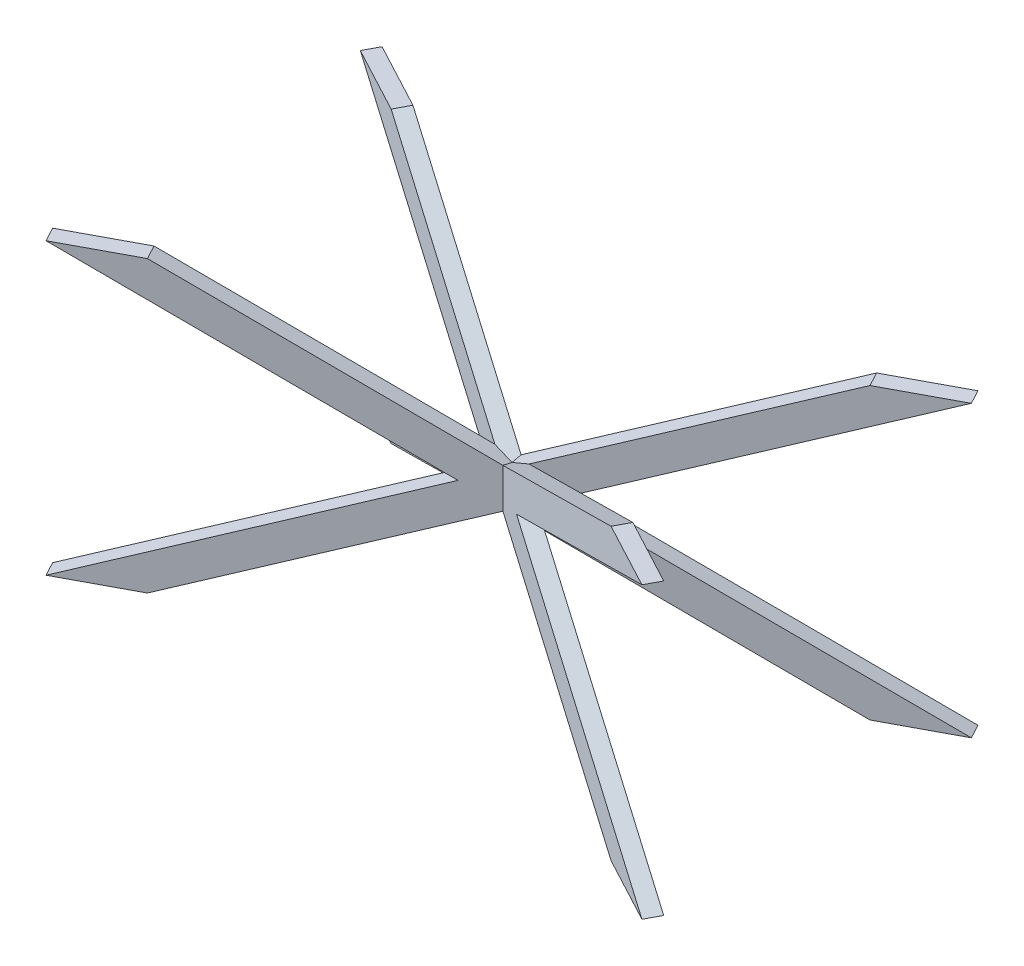
ISO-10303-21;
HEADER;
FILE_DESCRIPTION(('STEP AP214'),'2;1');
FILE_NAME('part.step','',(''),(''),'','','');
FILE_SCHEMA(('AUTOMOTIVE_DESIGN { 1 0 10303 214 1 1 1 1 }'));
ENDSEC;
DATA;
#1=APPLICATION_CONTEXT('core data for automotive mechanical design processes');
#2=APPLICATION_PROTOCOL_DEFINITION('international standard','automotive_design',2000,#1);
#3=PRODUCT_CONTEXT('',#1,'mechanical');
#4=PRODUCT('Part','Part','',(#3));
#5=PRODUCT_RELATED_PRODUCT_CATEGORY('part','',(#4));
#6=PRODUCT_DEFINITION_FORMATION('','',#4);
#7=PRODUCT_DEFINITION_CONTEXT('part definition',#1,'design');
#8=PRODUCT_DEFINITION('design','',#6,#7);
#9=PRODUCT_DEFINITION_SHAPE('','',#8);
#10=(LENGTH_UNIT() NAMED_UNIT(*) SI_UNIT(.MILLI.,.METRE.));
#11=(NAMED_UNIT(*) PLANE_ANGLE_UNIT() SI_UNIT($,.RADIAN.));
#12=(NAMED_UNIT(*) SI_UNIT($,.STERADIAN.) SOLID_ANGLE_UNIT());
#13=UNCERTAINTY_MEASURE_WITH_UNIT(LENGTH_MEASURE(1.E-05),#10,'distance_accuracy_value','');
#14=(GEOMETRIC_REPRESENTATION_CONTEXT(3) GLOBAL_UNCERTAINTY_ASSIGNED_CONTEXT((#13)) GLOBAL_UNIT_ASSIGNED_CONTEXT((#10,
#11,#12)) REPRESENTATION_CONTEXT('',''));
#15=CARTESIAN_POINT('',(0.,0.,0.));
#16=DIRECTION('',(0.,0.,1.));
#17=DIRECTION('',(1.,0.,0.));
#18=AXIS2_PLACEMENT_3D('',#15,#16,#17);
#19=CARTESIAN_POINT('',(188.940119565253,3.47973276361799E-13,-354.262724184849));
#20=DIRECTION('',(-0.470588235294118,0.,0.88235294117647));
#21=DIRECTION('',(0.882352941176471,0.,0.470588235294118));
#22=AXIS2_PLACEMENT_3D('',#19,#20,#21);
#23=PLANE('',#22);
#24=DIRECTION('',(0.,1.,0.));
#25=VECTOR('',#24,1.);
#26=CARTESIAN_POINT('',(103.182727411845,1.98237999937058E-13,-400.));
#27=LINE('',#26,#25);
#28=CARTESIAN_POINT('',(103.182727411845,13.9767018772309,-400.));
#29=VERTEX_POINT('',#28);
#30=CARTESIAN_POINT('',(103.182727411842,138.238063223439,-399.999999999999));
#31=VERTEX_POINT('',#30);
#32=EDGE_CURVE('E343',#29,#31,#27,.T.);
#33=ORIENTED_EDGE('',*,*,#32,.T.);
#34=DIRECTION('',(-0.796811752551733,-0.429528464754243,-0.424966268027591));
#35=VECTOR('',#34,1.);
#36=CARTESIAN_POINT('',(-679.905507882273,-283.892617449664,-817.64705882353));
#37=LINE('',#36,#35);
#38=CARTESIAN_POINT('',(655.75559240242,436.107382550336,-105.294472005027));
#39=VERTEX_POINT('',#38);
#40=EDGE_CURVE('E377',#39,#31,#37,.T.);
#41=ORIENTED_EDGE('',*,*,#40,.F.);
#42=DIRECTION('',(-0.882352941176471,0.,-0.470588235294118));
#43=VECTOR('',#42,1.);
#44=CARTESIAN_POINT('',(655.75559240242,436.107382550336,-105.294472005027));
#45=LINE('',#44,#43);
#46=CARTESIAN_POINT('',(820.094492117727,436.107382550336,-17.6470588235294));
#47=VERTEX_POINT('',#46);
#48=EDGE_CURVE('E373',#47,#39,#45,.T.);
#49=ORIENTED_EDGE('',*,*,#48,.F.);
#50=DIRECTION('',(0.796811752551733,0.429528464754244,0.424966268027591));
#51=VECTOR('',#50,1.);
#52=CARTESIAN_POINT('',(820.094492117727,436.107382550336,-17.6470588235294));
#53=LINE('',#52,#51);
#54=CARTESIAN_POINT('',(152.263941975381,76.1073825503356,-373.823352232781));
#55=VERTEX_POINT('',#54);
#56=EDGE_CURVE('E370',#55,#47,#53,.T.);
#57=ORIENTED_EDGE('',*,*,#56,.F.);
#58=DIRECTION('',(-0.796811752551733,0.429528464754243,-0.424966268027591));
#59=VECTOR('',#58,1.);
#60=CARTESIAN_POINT('',(820.094492117727,-283.892617449664,-17.6470588235295));
#61=LINE('',#60,#59);
#62=CARTESIAN_POINT('',(820.094492117727,-283.892617449664,-17.6470588235295));
#63=VERTEX_POINT('',#62);
#64=EDGE_CURVE('E422',#63,#55,#61,.T.);
#65=ORIENTED_EDGE('',*,*,#64,.F.);
#66=DIRECTION('',(0.88235294117647,0.,0.470588235294118));
#67=VECTOR('',#66,1.);
#68=CARTESIAN_POINT('',(655.755592402419,-283.892617449664,-105.294472005027));
#69=LINE('',#68,#67);
#70=CARTESIAN_POINT('',(655.755592402419,-283.892617449664,-105.294472005027));
#71=VERTEX_POINT('',#70);
#72=EDGE_CURVE('E418',#71,#63,#69,.T.);
#73=ORIENTED_EDGE('',*,*,#72,.F.);
#74=DIRECTION('',(0.796811752551733,-0.429528464754244,0.424966268027591));
#75=VECTOR('',#74,1.);
#76=CARTESIAN_POINT('',(-679.905507882273,436.107382550336,-817.64705882353));
#77=LINE('',#76,#75);
#78=EDGE_CURVE('E414',#29,#71,#77,.T.);
#79=ORIENTED_EDGE('',*,*,#78,.F.);
#80=EDGE_LOOP('',(#33,#41,#49,#57,#65,#73,#79));
#81=FACE_BOUND('',#80,.T.);
#82=ADVANCED_FACE('F42',(#81),#23,.F.);
#83=CARTESIAN_POINT('',(170.116590153488,3.42279728086539E-13,-318.96860653779));
#84=DIRECTION('',(-0.470588235294118,0.,0.88235294117647));
#85=DIRECTION('',(0.882352941176471,0.,0.470588235294118));
#86=AXIS2_PLACEMENT_3D('',#83,#84,#85);
#87=PLANE('',#86);
#88=DIRECTION('',(0.,1.,0.));
#89=VECTOR('',#88,1.);
#90=CARTESIAN_POINT('',(60.6827274118447,1.51204541722026E-13,-377.333333333333));
#91=LINE('',#90,#89);
#92=CARTESIAN_POINT('',(60.6827274118445,26.7397140065025,-377.333333333333));
#93=VERTEX_POINT('',#92);
#94=CARTESIAN_POINT('',(60.6827274118447,125.475051094169,-377.333333333333));
#95=VERTEX_POINT('',#94);
#96=EDGE_CURVE('E334',#93,#95,#91,.T.);
#97=ORIENTED_EDGE('',*,*,#96,.F.);
#98=DIRECTION('',(0.796811752551733,-0.429528464754244,0.424966268027591));
#99=VECTOR('',#98,1.);
#100=CARTESIAN_POINT('',(-698.729037294038,436.107382550336,-782.352941176471));
#101=LINE('',#100,#99);
#102=CARTESIAN_POINT('',(636.932062990655,-283.892617449664,-70.0003543579681));
#103=VERTEX_POINT('',#102);
#104=EDGE_CURVE('E399',#93,#103,#101,.T.);
#105=ORIENTED_EDGE('',*,*,#104,.T.);
#106=DIRECTION('',(0.88235294117647,0.,0.470588235294118));
#107=VECTOR('',#106,1.);
#108=CARTESIAN_POINT('',(636.932062990655,-283.892617449664,-70.0003543579681));
#109=LINE('',#108,#107);
#110=CARTESIAN_POINT('',(801.270962705962,-283.892617449664,17.6470588235294));
#111=VERTEX_POINT('',#110);
#112=EDGE_CURVE('E403',#103,#111,#109,.T.);
#113=ORIENTED_EDGE('',*,*,#112,.T.);
#114=DIRECTION('',(-0.796811752551733,0.429528464754243,-0.424966268027591));
#115=VECTOR('',#114,1.);
#116=CARTESIAN_POINT('',(801.270962705962,-283.892617449664,17.6470588235294));
#117=LINE('',#116,#115);
#118=CARTESIAN_POINT('',(133.440412563616,76.1073825503356,-338.529234585722));
#119=VERTEX_POINT('',#118);
#120=EDGE_CURVE('E407',#111,#119,#117,.T.);
#121=ORIENTED_EDGE('',*,*,#120,.T.);
#122=DIRECTION('',(0.796811752551733,0.429528464754244,0.424966268027591));
#123=VECTOR('',#122,1.);
#124=CARTESIAN_POINT('',(801.270962705962,436.107382550336,17.6470588235295));
#125=LINE('',#124,#123);
#126=CARTESIAN_POINT('',(801.270962705962,436.107382550336,17.6470588235295));
#127=VERTEX_POINT('',#126);
#128=EDGE_CURVE('E356',#119,#127,#125,.T.);
#129=ORIENTED_EDGE('',*,*,#128,.T.);
#130=DIRECTION('',(-0.882352941176471,0.,-0.470588235294118));
#131=VECTOR('',#130,1.);
#132=CARTESIAN_POINT('',(636.932062990655,436.107382550336,-70.0003543579678));
#133=LINE('',#132,#131);
#134=CARTESIAN_POINT('',(636.932062990655,436.107382550336,-70.0003543579678));
#135=VERTEX_POINT('',#134);
#136=EDGE_CURVE('E359',#127,#135,#133,.T.);
#137=ORIENTED_EDGE('',*,*,#136,.T.);
#138=DIRECTION('',(-0.796811752551733,-0.429528464754243,-0.424966268027591));
#139=VECTOR('',#138,1.);
#140=CARTESIAN_POINT('',(-698.729037294038,-283.892617449664,-782.352941176471));
#141=LINE('',#140,#139);
#142=EDGE_CURVE('E363',#135,#95,#141,.T.);
#143=ORIENTED_EDGE('',*,*,#142,.T.);
#144=EDGE_LOOP('',(#97,#105,#113,#121,#129,#137,#143));
#145=FACE_BOUND('',#144,.T.);
#146=ADVANCED_FACE('F504',(#145),#87,.T.);
#147=CARTESIAN_POINT('',(60.682727411845,125.475051094169,-422.666666666667));
#148=VERTEX_POINT('',#147);
#149=CARTESIAN_POINT('',(-515.566608166966,436.107382550336,-729.999645642032));
#150=VERTEX_POINT('',#149);
#151=EDGE_CURVE('E421',#148,#150,#61,.T.);
#152=ORIENTED_EDGE('',*,*,#151,.F.);
#153=DIRECTION('',(0.,1.,0.));
#154=VECTOR('',#153,1.);
#155=CARTESIAN_POINT('',(60.6827274118447,1.24031577747032E-13,-422.666666666667));
#156=LINE('',#155,#154);
#157=CARTESIAN_POINT('',(60.6827274118452,26.7397140065025,-422.666666666667));
#158=VERTEX_POINT('',#157);
#159=EDGE_CURVE('E350',#158,#148,#156,.T.);
#160=ORIENTED_EDGE('',*,*,#159,.F.);
#161=CARTESIAN_POINT('',(-515.566608166965,-283.892617449664,-729.999645642032));
#162=VERTEX_POINT('',#161);
#163=EDGE_CURVE('E371',#162,#158,#53,.T.);
#164=ORIENTED_EDGE('',*,*,#163,.F.);
#165=DIRECTION('',(0.882352941176471,0.,0.470588235294118));
#166=VECTOR('',#165,1.);
#167=CARTESIAN_POINT('',(-679.905507882273,-283.892617449664,-817.64705882353));
#168=LINE('',#167,#166);
#169=CARTESIAN_POINT('',(-679.905507882273,-283.892617449664,-817.64705882353));
#170=VERTEX_POINT('',#169);
#171=EDGE_CURVE('E367',#170,#162,#168,.T.);
#172=ORIENTED_EDGE('',*,*,#171,.F.);
#173=CARTESIAN_POINT('',(-12.0749577399273,76.1073825503352,-461.470765414278));
#174=VERTEX_POINT('',#173);
#175=EDGE_CURVE('E376',#174,#170,#37,.T.);
#176=ORIENTED_EDGE('',*,*,#175,.F.);
#177=CARTESIAN_POINT('',(-679.905507882273,436.107382550336,-817.64705882353));
#178=VERTEX_POINT('',#177);
#179=EDGE_CURVE('E415',#178,#174,#77,.T.);
#180=ORIENTED_EDGE('',*,*,#179,.F.);
#181=DIRECTION('',(-0.88235294117647,0.,-0.470588235294118));
#182=VECTOR('',#181,1.);
#183=CARTESIAN_POINT('',(-679.905507882273,436.107382550336,-817.64705882353));
#184=LINE('',#183,#182);
#185=EDGE_CURVE('E411',#150,#178,#184,.T.);
#186=ORIENTED_EDGE('',*,*,#185,.F.);
#187=EDGE_LOOP('',(#152,#160,#164,#172,#176,#180,#186));
#188=FACE_BOUND('',#187,.T.);
#189=ADVANCED_FACE('F477',(#188),#23,.F.);
#190=CARTESIAN_POINT('',(-534.39013757873,-283.892617449664,-694.705527994973));
#191=VERTEX_POINT('',#190);
#192=CARTESIAN_POINT('',(18.1827274118375,13.9767018772281,-399.999999999996));
#193=VERTEX_POINT('',#192);
#194=EDGE_CURVE('E357',#191,#193,#125,.T.);
#195=ORIENTED_EDGE('',*,*,#194,.T.);
#196=DIRECTION('',(0.,1.,0.));
#197=VECTOR('',#196,1.);
#198=CARTESIAN_POINT('',(18.1827274118448,0.,-400.));
#199=LINE('',#198,#197);
#200=CARTESIAN_POINT('',(18.1827274118444,138.23806322344,-400.));
#201=VERTEX_POINT('',#200);
#202=EDGE_CURVE('E65',#193,#201,#199,.T.);
#203=ORIENTED_EDGE('',*,*,#202,.T.);
#204=CARTESIAN_POINT('',(-534.390137578731,436.107382550336,-694.705527994973));
#205=VERTEX_POINT('',#204);
#206=EDGE_CURVE('E406',#201,#205,#117,.T.);
#207=ORIENTED_EDGE('',*,*,#206,.T.);
#208=DIRECTION('',(-0.88235294117647,0.,-0.470588235294118));
#209=VECTOR('',#208,1.);
#210=CARTESIAN_POINT('',(-698.729037294038,436.107382550336,-782.352941176471));
#211=LINE('',#210,#209);
#212=CARTESIAN_POINT('',(-698.729037294038,436.107382550336,-782.352941176471));
#213=VERTEX_POINT('',#212);
#214=EDGE_CURVE('E396',#205,#213,#211,.T.);
#215=ORIENTED_EDGE('',*,*,#214,.T.);
#216=CARTESIAN_POINT('',(-30.898487151692,76.1073825503352,-426.176647767219));
#217=VERTEX_POINT('',#216);
#218=EDGE_CURVE('E400',#213,#217,#101,.T.);
#219=ORIENTED_EDGE('',*,*,#218,.T.);
#220=CARTESIAN_POINT('',(-698.729037294038,-283.892617449664,-782.352941176471));
#221=VERTEX_POINT('',#220);
#222=EDGE_CURVE('E362',#217,#221,#141,.T.);
#223=ORIENTED_EDGE('',*,*,#222,.T.);
#224=DIRECTION('',(0.882352941176471,0.,0.470588235294118));
#225=VECTOR('',#224,1.);
#226=CARTESIAN_POINT('',(-698.729037294038,-283.892617449664,-782.352941176471));
#227=LINE('',#226,#225);
#228=EDGE_CURVE('E353',#221,#191,#227,.T.);
#229=ORIENTED_EDGE('',*,*,#228,.T.);
#230=EDGE_LOOP('',(#195,#203,#207,#215,#219,#223,#229));
#231=FACE_BOUND('',#230,.T.);
#232=ADVANCED_FACE('F468',(#231),#87,.T.);
#233=CARTESIAN_POINT('',(820.094492117727,-283.892617449664,-17.6470588235295));
#234=DIRECTION('',(0.378995704194921,0.903053319558631,0.202131042237291));
#235=DIRECTION('',(-0.922086583786844,0.386983632729224,0.));
#236=AXIS2_PLACEMENT_3D('',#233,#234,#235);
#237=PLANE('',#236);
#238=DIRECTION('',(0.,-0.218425961676343,0.975853523468438));
#239=VECTOR('',#238,1.);
#240=CARTESIAN_POINT('',(60.6827274118444,19.613524369039,50.286928508711));
#241=LINE('',#240,#239);
#242=CARTESIAN_POINT('',(60.6827274118444,120.401555589365,-400.));
#243=VERTEX_POINT('',#242);
#244=EDGE_CURVE('E293',#148,#243,#241,.T.);
#245=ORIENTED_EDGE('',*,*,#244,.F.);
#246=ORIENTED_EDGE('',*,*,#151,.T.);
#247=DIRECTION('',(-0.470588235294118,0.,0.882352941176471));
#248=VECTOR('',#247,1.);
#249=CARTESIAN_POINT('',(-515.566608166966,436.107382550336,-729.999645642032));
#250=LINE('',#249,#248);
#251=EDGE_CURVE('E427',#150,#205,#250,.T.);
#252=ORIENTED_EDGE('',*,*,#251,.T.);
#253=ORIENTED_EDGE('',*,*,#206,.F.);
#254=DIRECTION('',(-0.922086583786844,0.386983632729224,0.));
#255=VECTOR('',#254,1.);
#256=CARTESIAN_POINT('',(850.633038251123,-211.126791465331,-400.));
#257=LINE('',#256,#255);
#258=EDGE_CURVE('E346',#243,#201,#257,.T.);
#259=ORIENTED_EDGE('',*,*,#258,.F.);
#260=EDGE_LOOP('',(#245,#246,#252,#253,#259));
#261=FACE_BOUND('',#260,.T.);
#262=ADVANCED_FACE('F484',(#261),#237,.T.);
#263=CARTESIAN_POINT('',(-679.905507882273,436.107382550336,-817.64705882353));
#264=DIRECTION('',(-0.378995704194921,-0.903053319558631,-0.202131042237291));
#265=DIRECTION('',(0.922086583786844,-0.386983632729224,0.));
#266=AXIS2_PLACEMENT_3D('',#263,#264,#265);
#267=PLANE('',#266);
#268=DIRECTION('',(0.470588235294118,0.,-0.882352941176471));
#269=VECTOR('',#268,1.);
#270=CARTESIAN_POINT('',(-12.0749577399268,76.1073825503354,-461.470765414278));
#271=LINE('',#270,#269);
#272=EDGE_CURVE('E394',#217,#174,#271,.T.);
#273=ORIENTED_EDGE('',*,*,#272,.F.);
#274=ORIENTED_EDGE('',*,*,#218,.F.);
#275=DIRECTION('',(-0.470588235294118,0.,0.882352941176471));
#276=VECTOR('',#275,1.);
#277=CARTESIAN_POINT('',(-679.905507882273,436.107382550336,-817.64705882353));
#278=LINE('',#277,#276);
#279=EDGE_CURVE('E426',#178,#213,#278,.T.);
#280=ORIENTED_EDGE('',*,*,#279,.F.);
#281=ORIENTED_EDGE('',*,*,#179,.T.);
#282=EDGE_LOOP('',(#273,#274,#280,#281));
#283=FACE_BOUND('',#282,.T.);
#284=ADVANCED_FACE('F553',(#283),#267,.T.);
#285=CARTESIAN_POINT('',(-679.905507882273,436.107382550336,-817.64705882353));
#286=DIRECTION('',(0.,1.,0.));
#287=DIRECTION('',(0.,0.,1.));
#288=AXIS2_PLACEMENT_3D('',#285,#286,#287);
#289=PLANE('',#288);
#290=ORIENTED_EDGE('',*,*,#279,.T.);
#291=ORIENTED_EDGE('',*,*,#214,.F.);
#292=ORIENTED_EDGE('',*,*,#251,.F.);
#293=ORIENTED_EDGE('',*,*,#185,.T.);
#294=EDGE_LOOP('',(#290,#291,#292,#293));
#295=FACE_BOUND('',#294,.T.);
#296=ADVANCED_FACE('F44',(#295),#289,.T.);
#297=DIRECTION('',(0.470588235294118,0.,-0.882352941176471));
#298=VECTOR('',#297,1.);
#299=CARTESIAN_POINT('',(152.263941975381,76.1073825503354,-373.823352232781));
#300=LINE('',#299,#298);
#301=EDGE_CURVE('E385',#119,#55,#300,.T.);
#302=ORIENTED_EDGE('',*,*,#301,.F.);
#303=ORIENTED_EDGE('',*,*,#120,.F.);
#304=DIRECTION('',(-0.470588235294118,0.,0.882352941176471));
#305=VECTOR('',#304,1.);
#306=CARTESIAN_POINT('',(820.094492117727,-283.892617449664,-17.6470588235295));
#307=LINE('',#306,#305);
#308=EDGE_CURVE('E431',#63,#111,#307,.T.);
#309=ORIENTED_EDGE('',*,*,#308,.F.);
#310=ORIENTED_EDGE('',*,*,#64,.T.);
#311=EDGE_LOOP('',(#302,#303,#309,#310));
#312=FACE_BOUND('',#311,.T.);
#313=ADVANCED_FACE('F545',(#312),#237,.T.);
#314=CARTESIAN_POINT('',(655.755592402419,-283.892617449664,-105.294472005027));
#315=DIRECTION('',(0.,-1.,0.));
#316=DIRECTION('',(0.,0.,-1.));
#317=AXIS2_PLACEMENT_3D('',#314,#315,#316);
#318=PLANE('',#317);
#319=ORIENTED_EDGE('',*,*,#308,.T.);
#320=ORIENTED_EDGE('',*,*,#112,.F.);
#321=DIRECTION('',(-0.470588235294118,0.,0.882352941176471));
#322=VECTOR('',#321,1.);
#323=CARTESIAN_POINT('',(655.755592402419,-283.892617449664,-105.294472005027));
#324=LINE('',#323,#322);
#325=EDGE_CURVE('E433',#71,#103,#324,.T.);
#326=ORIENTED_EDGE('',*,*,#325,.F.);
#327=ORIENTED_EDGE('',*,*,#72,.T.);
#328=EDGE_LOOP('',(#319,#320,#326,#327));
#329=FACE_BOUND('',#328,.T.);
#330=ADVANCED_FACE('F550',(#329),#318,.T.);
#331=DIRECTION('',(0.,-0.218425961676343,0.975853523468438));
#332=VECTOR('',#331,1.);
#333=CARTESIAN_POINT('',(60.6827274118448,140.124243472297,-883.897167306326));
#334=LINE('',#333,#332);
#335=CARTESIAN_POINT('',(60.6827274118448,31.8132095113061,-400.));
#336=VERTEX_POINT('',#335);
#337=EDGE_CURVE('E240',#336,#93,#334,.T.);
#338=ORIENTED_EDGE('',*,*,#337,.F.);
#339=DIRECTION('',(-0.922086583786844,0.386983632729224,0.));
#340=VECTOR('',#339,1.);
#341=CARTESIAN_POINT('',(-713.262996735675,356.624711090525,-400.));
#342=LINE('',#341,#340);
#343=EDGE_CURVE('E57',#29,#336,#342,.T.);
#344=ORIENTED_EDGE('',*,*,#343,.F.);
#345=ORIENTED_EDGE('',*,*,#78,.T.);
#346=ORIENTED_EDGE('',*,*,#325,.T.);
#347=ORIENTED_EDGE('',*,*,#104,.F.);
#348=EDGE_LOOP('',(#338,#344,#345,#346,#347));
#349=FACE_BOUND('',#348,.T.);
#350=ADVANCED_FACE('F551',(#349),#267,.T.);
#351=CARTESIAN_POINT('',(-679.905507882273,-283.892617449664,-817.64705882353));
#352=DIRECTION('',(0.,-1.,0.));
#353=DIRECTION('',(0.,0.,-1.));
#354=AXIS2_PLACEMENT_3D('',#351,#352,#353);
#355=PLANE('',#354);
#356=DIRECTION('',(-0.470588235294118,0.,0.882352941176471));
#357=VECTOR('',#356,1.);
#358=CARTESIAN_POINT('',(-515.566608166965,-283.892617449664,-729.999645642032));
#359=LINE('',#358,#357);
#360=EDGE_CURVE('E381',#162,#191,#359,.T.);
#361=ORIENTED_EDGE('',*,*,#360,.T.);
#362=ORIENTED_EDGE('',*,*,#228,.F.);
#363=DIRECTION('',(-0.470588235294118,0.,0.882352941176471));
#364=VECTOR('',#363,1.);
#365=CARTESIAN_POINT('',(-679.905507882273,-283.892617449664,-817.64705882353));
#366=LINE('',#365,#364);
#367=EDGE_CURVE('E382',#170,#221,#366,.T.);
#368=ORIENTED_EDGE('',*,*,#367,.F.);
#369=ORIENTED_EDGE('',*,*,#171,.T.);
#370=EDGE_LOOP('',(#361,#362,#368,#369));
#371=FACE_BOUND('',#370,.T.);
#372=ADVANCED_FACE('F472',(#371),#355,.T.);
#373=CARTESIAN_POINT('',(820.094492117727,436.107382550336,-17.6470588235294));
#374=DIRECTION('',(0.378995704194921,-0.903053319558631,0.202131042237291));
#375=DIRECTION('',(0.922086583786844,0.386983632729224,0.));
#376=AXIS2_PLACEMENT_3D('',#373,#374,#375);
#377=PLANE('',#376);
#378=DIRECTION('',(0.922086583786844,0.386983632729224,0.));
#379=VECTOR('',#378,1.);
#380=CARTESIAN_POINT('',(850.633038251123,363.341556566002,-400.));
#381=LINE('',#380,#379);
#382=EDGE_CURVE('E287',#193,#336,#381,.T.);
#383=ORIENTED_EDGE('',*,*,#382,.F.);
#384=ORIENTED_EDGE('',*,*,#194,.F.);
#385=ORIENTED_EDGE('',*,*,#360,.F.);
#386=ORIENTED_EDGE('',*,*,#163,.T.);
#387=DIRECTION('',(0.,-0.218425961676343,-0.975853523468438));
#388=VECTOR('',#387,1.);
#389=CARTESIAN_POINT('',(60.6827274118447,132.601240731632,50.2869285087109));
#390=LINE('',#389,#388);
#391=EDGE_CURVE('E50',#336,#158,#390,.T.);
#392=ORIENTED_EDGE('',*,*,#391,.F.);
#393=EDGE_LOOP('',(#383,#384,#385,#386,#392));
#394=FACE_BOUND('',#393,.T.);
#395=ADVANCED_FACE('F467',(#394),#377,.T.);
#396=CARTESIAN_POINT('',(-679.905507882273,-283.892617449664,-817.64705882353));
#397=DIRECTION('',(-0.378995704194921,0.903053319558631,-0.202131042237291));
#398=DIRECTION('',(-0.922086583786844,-0.386983632729224,0.));
#399=AXIS2_PLACEMENT_3D('',#396,#397,#398);
#400=PLANE('',#399);
#401=ORIENTED_EDGE('',*,*,#222,.F.);
#402=ORIENTED_EDGE('',*,*,#272,.T.);
#403=ORIENTED_EDGE('',*,*,#175,.T.);
#404=ORIENTED_EDGE('',*,*,#367,.T.);
#405=EDGE_LOOP('',(#401,#402,#403,#404));
#406=FACE_BOUND('',#405,.T.);
#407=ADVANCED_FACE('F579',(#406),#400,.T.);
#408=DIRECTION('',(0.922086583786844,0.386983632729224,0.));
#409=VECTOR('',#408,1.);
#410=CARTESIAN_POINT('',(-713.262996735675,-204.409945989854,-400.));
#411=LINE('',#410,#409);
#412=EDGE_CURVE('E290',#243,#31,#411,.T.);
#413=ORIENTED_EDGE('',*,*,#412,.F.);
#414=DIRECTION('',(0.,-0.218425961676343,-0.975853523468438));
#415=VECTOR('',#414,1.);
#416=CARTESIAN_POINT('',(60.6827274118446,12.090521628374,-883.897167306326));
#417=LINE('',#416,#415);
#418=EDGE_CURVE('E430',#95,#243,#417,.T.);
#419=ORIENTED_EDGE('',*,*,#418,.F.);
#420=ORIENTED_EDGE('',*,*,#142,.F.);
#421=DIRECTION('',(-0.470588235294118,0.,0.882352941176471));
#422=VECTOR('',#421,1.);
#423=CARTESIAN_POINT('',(655.75559240242,436.107382550336,-105.294472005027));
#424=LINE('',#423,#422);
#425=EDGE_CURVE('E386',#39,#135,#424,.T.);
#426=ORIENTED_EDGE('',*,*,#425,.F.);
#427=ORIENTED_EDGE('',*,*,#40,.T.);
#428=EDGE_LOOP('',(#413,#419,#420,#426,#427));
#429=FACE_BOUND('',#428,.T.);
#430=ADVANCED_FACE('F503',(#429),#400,.T.);
#431=ORIENTED_EDGE('',*,*,#128,.F.);
#432=ORIENTED_EDGE('',*,*,#301,.T.);
#433=ORIENTED_EDGE('',*,*,#56,.T.);
#434=DIRECTION('',(-0.470588235294118,0.,0.882352941176471));
#435=VECTOR('',#434,1.);
#436=CARTESIAN_POINT('',(820.094492117727,436.107382550336,-17.6470588235294));
#437=LINE('',#436,#435);
#438=EDGE_CURVE('E388',#47,#127,#437,.T.);
#439=ORIENTED_EDGE('',*,*,#438,.T.);
#440=EDGE_LOOP('',(#431,#432,#433,#439));
#441=FACE_BOUND('',#440,.T.);
#442=ADVANCED_FACE('F541',(#441),#377,.T.);
#443=CARTESIAN_POINT('',(655.75559240242,436.107382550336,-105.294472005027));
#444=DIRECTION('',(0.,1.,0.));
#445=DIRECTION('',(0.,0.,1.));
#446=AXIS2_PLACEMENT_3D('',#443,#444,#445);
#447=PLANE('',#446);
#448=ORIENTED_EDGE('',*,*,#425,.T.);
#449=ORIENTED_EDGE('',*,*,#136,.F.);
#450=ORIENTED_EDGE('',*,*,#438,.F.);
#451=ORIENTED_EDGE('',*,*,#48,.T.);
#452=EDGE_LOOP('',(#448,#449,#450,#451));
#453=FACE_BOUND('',#452,.T.);
#454=ADVANCED_FACE('F508',(#453),#447,.T.);
#455=CARTESIAN_POINT('',(-534.390137578731,436.107382550336,-105.294472005026));
#456=DIRECTION('',(0.,1.,0.));
#457=DIRECTION('',(0.,0.,1.));
#458=AXIS2_PLACEMENT_3D('',#455,#456,#457);
#459=PLANE('',#458);
#460=DIRECTION('',(0.470588235294118,0.,0.882352941176471));
#461=VECTOR('',#460,1.);
#462=CARTESIAN_POINT('',(-698.729037294038,436.107382550336,-17.6470588235293));
#463=LINE('',#462,#461);
#464=CARTESIAN_POINT('',(-698.729037294038,436.107382550336,-17.6470588235293));
#465=VERTEX_POINT('',#464);
#466=CARTESIAN_POINT('',(-679.905507882273,436.107382550336,17.6470588235295));
#467=VERTEX_POINT('',#466);
#468=EDGE_CURVE('E335',#465,#467,#463,.T.);
#469=ORIENTED_EDGE('',*,*,#468,.T.);
#470=DIRECTION('',(-0.882352941176471,0.,0.470588235294118));
#471=VECTOR('',#470,1.);
#472=CARTESIAN_POINT('',(-515.566608166966,436.107382550336,-70.0003543579676));
#473=LINE('',#472,#471);
#474=CARTESIAN_POINT('',(-515.566608166966,436.107382550336,-70.0003543579676));
#475=VERTEX_POINT('',#474);
#476=EDGE_CURVE('E304',#475,#467,#473,.T.);
#477=ORIENTED_EDGE('',*,*,#476,.F.);
#478=DIRECTION('',(0.470588235294118,0.,0.882352941176471));
#479=VECTOR('',#478,1.);
#480=CARTESIAN_POINT('',(-534.390137578731,436.107382550336,-105.294472005026));
#481=LINE('',#480,#479);
#482=CARTESIAN_POINT('',(-534.390137578731,436.107382550336,-105.294472005026));
#483=VERTEX_POINT('',#482);
#484=EDGE_CURVE('E337',#483,#475,#481,.T.);
#485=ORIENTED_EDGE('',*,*,#484,.F.);
#486=DIRECTION('',(-0.882352941176471,0.,0.470588235294118));
#487=VECTOR('',#486,1.);
#488=CARTESIAN_POINT('',(-534.390137578731,436.107382550336,-105.294472005026));
#489=LINE('',#488,#487);
#490=EDGE_CURVE('E320',#483,#465,#489,.T.);
#491=ORIENTED_EDGE('',*,*,#490,.T.);
#492=EDGE_LOOP('',(#469,#477,#485,#491));
#493=FACE_BOUND('',#492,.T.);
#494=ADVANCED_FACE('F496',(#493),#459,.T.);
#495=CARTESIAN_POINT('',(801.270962705963,-283.892617449664,-817.64705882353));
#496=DIRECTION('',(0.378995704194921,0.903053319558631,-0.202131042237291));
#497=DIRECTION('',(-0.922086583786844,0.386983632729224,0.));
#498=AXIS2_PLACEMENT_3D('',#495,#496,#497);
#499=PLANE('',#498);
#500=ORIENTED_EDGE('',*,*,#418,.T.);
#501=ORIENTED_EDGE('',*,*,#258,.T.);
#502=DIRECTION('',(-0.796811752551733,0.429528464754243,0.424966268027591));
#503=VECTOR('',#502,1.);
#504=CARTESIAN_POINT('',(801.270962705963,-283.892617449664,-817.64705882353));
#505=LINE('',#504,#503);
#506=EDGE_CURVE('E315',#201,#483,#505,.T.);
#507=ORIENTED_EDGE('',*,*,#506,.T.);
#508=ORIENTED_EDGE('',*,*,#484,.T.);
#509=DIRECTION('',(-0.796811752551733,0.429528464754243,0.424966268027591));
#510=VECTOR('',#509,1.);
#511=CARTESIAN_POINT('',(820.094492117727,-283.892617449664,-782.352941176471));
#512=LINE('',#511,#510);
#513=EDGE_CURVE('E299',#95,#475,#512,.T.);
#514=ORIENTED_EDGE('',*,*,#513,.F.);
#515=EDGE_LOOP('',(#500,#501,#507,#508,#514));
#516=FACE_BOUND('',#515,.T.);
#517=ADVANCED_FACE('F490',(#516),#499,.T.);
#518=CARTESIAN_POINT('',(-143.239811230595,-2.54382548861982E-13,-268.574646057365));
#519=DIRECTION('',(0.470588235294118,0.,0.88235294117647));
#520=DIRECTION('',(0.88235294117647,0.,-0.470588235294118));
#521=AXIS2_PLACEMENT_3D('',#518,#519,#520);
#522=PLANE('',#521);
#523=DIRECTION('',(0.796811752551733,-0.429528464754243,-0.424966268027591));
#524=VECTOR('',#523,1.);
#525=CARTESIAN_POINT('',(-679.905507882273,436.107382550336,17.6470588235295));
#526=LINE('',#525,#524);
#527=CARTESIAN_POINT('',(-12.0749577399267,76.1073825503355,-338.529234585722));
#528=VERTEX_POINT('',#527);
#529=EDGE_CURVE('E308',#467,#528,#526,.T.);
#530=ORIENTED_EDGE('',*,*,#529,.T.);
#531=DIRECTION('',(-0.796811752551733,-0.429528464754244,0.424966268027591));
#532=VECTOR('',#531,1.);
#533=CARTESIAN_POINT('',(-679.905507882273,-283.892617449664,17.6470588235294));
#534=LINE('',#533,#532);
#535=CARTESIAN_POINT('',(-679.905507882273,-283.892617449664,17.6470588235294));
#536=VERTEX_POINT('',#535);
#537=EDGE_CURVE('E249',#528,#536,#534,.T.);
#538=ORIENTED_EDGE('',*,*,#537,.T.);
#539=DIRECTION('',(0.882352941176471,0.,-0.470588235294118));
#540=VECTOR('',#539,1.);
#541=CARTESIAN_POINT('',(-515.566608166966,-283.892617449664,-70.0003543579679));
#542=LINE('',#541,#540);
#543=CARTESIAN_POINT('',(-515.566608166966,-283.892617449664,-70.0003543579679));
#544=VERTEX_POINT('',#543);
#545=EDGE_CURVE('E226',#536,#544,#542,.T.);
#546=ORIENTED_EDGE('',*,*,#545,.T.);
#547=DIRECTION('',(0.796811752551733,0.429528464754244,-0.424966268027591));
#548=VECTOR('',#547,1.);
#549=CARTESIAN_POINT('',(-515.566608166966,-283.892617449664,-70.0003543579679));
#550=LINE('',#549,#548);
#551=EDGE_CURVE('E238',#544,#93,#550,.T.);
#552=ORIENTED_EDGE('',*,*,#551,.T.);
#553=ORIENTED_EDGE('',*,*,#96,.T.);
#554=ORIENTED_EDGE('',*,*,#513,.T.);
#555=ORIENTED_EDGE('',*,*,#476,.T.);
#556=EDGE_LOOP('',(#530,#538,#546,#552,#553,#554,#555));
#557=FACE_BOUND('',#556,.T.);
#558=ADVANCED_FACE('F248',(#557),#522,.T.);
#559=CARTESIAN_POINT('',(-162.06334064236,-2.48689000586722E-13,-303.868763704424));
#560=DIRECTION('',(0.470588235294118,0.,0.88235294117647));
#561=DIRECTION('',(0.88235294117647,0.,-0.470588235294118));
#562=AXIS2_PLACEMENT_3D('',#559,#560,#561);
#563=PLANE('',#562);
#564=ORIENTED_EDGE('',*,*,#506,.F.);
#565=ORIENTED_EDGE('',*,*,#202,.F.);
#566=DIRECTION('',(0.796811752551733,0.429528464754244,-0.424966268027591));
#567=VECTOR('',#566,1.);
#568=CARTESIAN_POINT('',(-534.39013757873,-283.892617449664,-105.294472005027));
#569=LINE('',#568,#567);
#570=CARTESIAN_POINT('',(-534.39013757873,-283.892617449664,-105.294472005027));
#571=VERTEX_POINT('',#570);
#572=EDGE_CURVE('E266',#571,#193,#569,.T.);
#573=ORIENTED_EDGE('',*,*,#572,.F.);
#574=DIRECTION('',(0.882352941176471,0.,-0.470588235294118));
#575=VECTOR('',#574,1.);
#576=CARTESIAN_POINT('',(-534.39013757873,-283.892617449664,-105.294472005027));
#577=LINE('',#576,#575);
#578=CARTESIAN_POINT('',(-698.729037294038,-283.892617449664,-17.6470588235294));
#579=VERTEX_POINT('',#578);
#580=EDGE_CURVE('E228',#579,#571,#577,.T.);
#581=ORIENTED_EDGE('',*,*,#580,.F.);
#582=DIRECTION('',(-0.796811752551733,-0.429528464754244,0.424966268027591));
#583=VECTOR('',#582,1.);
#584=CARTESIAN_POINT('',(-698.729037294038,-283.892617449664,-17.6470588235294));
#585=LINE('',#584,#583);
#586=CARTESIAN_POINT('',(-30.8984871516914,76.1073825503355,-373.823352232781));
#587=VERTEX_POINT('',#586);
#588=EDGE_CURVE('E273',#587,#579,#585,.T.);
#589=ORIENTED_EDGE('',*,*,#588,.F.);
#590=DIRECTION('',(0.796811752551733,-0.429528464754243,-0.424966268027591));
#591=VECTOR('',#590,1.);
#592=CARTESIAN_POINT('',(-698.729037294038,436.107382550336,-17.6470588235293));
#593=LINE('',#592,#591);
#594=EDGE_CURVE('E325',#465,#587,#593,.T.);
#595=ORIENTED_EDGE('',*,*,#594,.F.);
#596=ORIENTED_EDGE('',*,*,#490,.F.);
#597=EDGE_LOOP('',(#564,#565,#573,#581,#589,#595,#596));
#598=FACE_BOUND('',#597,.T.);
#599=ADVANCED_FACE('F465',(#598),#563,.F.);
#600=CARTESIAN_POINT('',(-698.729037294038,436.107382550336,-17.6470588235293));
#601=DIRECTION('',(-0.378995704194921,-0.903053319558631,0.202131042237291));
#602=DIRECTION('',(0.922086583786844,-0.386983632729224,0.));
#603=AXIS2_PLACEMENT_3D('',#600,#601,#602);
#604=PLANE('',#603);
#605=DIRECTION('',(-0.470588235294118,0.,-0.882352941176471));
#606=VECTOR('',#605,1.);
#607=CARTESIAN_POINT('',(-30.8984871516913,76.1073825503356,-373.823352232781));
#608=LINE('',#607,#606);
#609=EDGE_CURVE('E11',#528,#587,#608,.T.);
#610=ORIENTED_EDGE('',*,*,#609,.F.);
#611=ORIENTED_EDGE('',*,*,#529,.F.);
#612=ORIENTED_EDGE('',*,*,#468,.F.);
#613=ORIENTED_EDGE('',*,*,#594,.T.);
#614=EDGE_LOOP('',(#610,#611,#612,#613));
#615=FACE_BOUND('',#614,.T.);
#616=ADVANCED_FACE('F593',(#615),#604,.T.);
#617=ORIENTED_EDGE('',*,*,#159,.T.);
#618=CARTESIAN_POINT('',(636.932062990655,436.107382550336,-729.999645642032));
#619=VERTEX_POINT('',#618);
#620=EDGE_CURVE('E234',#619,#148,#585,.T.);
#621=ORIENTED_EDGE('',*,*,#620,.F.);
#622=DIRECTION('',(-0.882352941176471,0.,0.470588235294117));
#623=VECTOR('',#622,1.);
#624=CARTESIAN_POINT('',(801.270962705963,436.107382550336,-817.647058823529));
#625=LINE('',#624,#623);
#626=CARTESIAN_POINT('',(801.270962705963,436.107382550336,-817.647058823529));
#627=VERTEX_POINT('',#626);
#628=EDGE_CURVE('E269',#627,#619,#625,.T.);
#629=ORIENTED_EDGE('',*,*,#628,.F.);
#630=CARTESIAN_POINT('',(133.440412563616,76.1073825503354,-461.470765414278));
#631=VERTEX_POINT('',#630);
#632=EDGE_CURVE('E265',#631,#627,#569,.T.);
#633=ORIENTED_EDGE('',*,*,#632,.F.);
#634=CARTESIAN_POINT('',(801.270962705963,-283.892617449664,-817.64705882353));
#635=VERTEX_POINT('',#634);
#636=EDGE_CURVE('E316',#635,#631,#505,.T.);
#637=ORIENTED_EDGE('',*,*,#636,.F.);
#638=DIRECTION('',(0.88235294117647,0.,-0.470588235294118));
#639=VECTOR('',#638,1.);
#640=CARTESIAN_POINT('',(801.270962705963,-283.892617449664,-817.64705882353));
#641=LINE('',#640,#639);
#642=CARTESIAN_POINT('',(636.932062990655,-283.892617449664,-729.999645642032));
#643=VERTEX_POINT('',#642);
#644=EDGE_CURVE('E311',#643,#635,#641,.T.);
#645=ORIENTED_EDGE('',*,*,#644,.F.);
#646=EDGE_CURVE('E324',#158,#643,#593,.T.);
#647=ORIENTED_EDGE('',*,*,#646,.F.);
#648=EDGE_LOOP('',(#617,#621,#629,#633,#637,#645,#647));
#649=FACE_BOUND('',#648,.T.);
#650=ADVANCED_FACE('F449',(#649),#563,.F.);
#651=DIRECTION('',(-0.470588235294118,0.,-0.882352941176471));
#652=VECTOR('',#651,1.);
#653=CARTESIAN_POINT('',(133.440412563616,76.1073825503353,-461.470765414278));
#654=LINE('',#653,#652);
#655=CARTESIAN_POINT('',(152.263941975381,76.1073825503356,-426.176647767219));
#656=VERTEX_POINT('',#655);
#657=EDGE_CURVE('E279',#656,#631,#654,.T.);
#658=ORIENTED_EDGE('',*,*,#657,.F.);
#659=CARTESIAN_POINT('',(820.094492117727,-283.892617449664,-782.352941176471));
#660=VERTEX_POINT('',#659);
#661=EDGE_CURVE('E300',#660,#656,#512,.T.);
#662=ORIENTED_EDGE('',*,*,#661,.F.);
#663=DIRECTION('',(0.470588235294118,0.,0.882352941176471));
#664=VECTOR('',#663,1.);
#665=CARTESIAN_POINT('',(801.270962705963,-283.892617449664,-817.64705882353));
#666=LINE('',#665,#664);
#667=EDGE_CURVE('E329',#635,#660,#666,.T.);
#668=ORIENTED_EDGE('',*,*,#667,.F.);
#669=ORIENTED_EDGE('',*,*,#636,.T.);
#670=EDGE_LOOP('',(#658,#662,#668,#669));
#671=FACE_BOUND('',#670,.T.);
#672=ADVANCED_FACE('F530',(#671),#499,.T.);
#673=ORIENTED_EDGE('',*,*,#661,.T.);
#674=CARTESIAN_POINT('',(820.094492117727,436.107382550336,-782.35294117647));
#675=VERTEX_POINT('',#674);
#676=EDGE_CURVE('E245',#656,#675,#550,.T.);
#677=ORIENTED_EDGE('',*,*,#676,.T.);
#678=DIRECTION('',(-0.882352941176471,0.,0.470588235294117));
#679=VECTOR('',#678,1.);
#680=CARTESIAN_POINT('',(820.094492117727,436.107382550336,-782.35294117647));
#681=LINE('',#680,#679);
#682=CARTESIAN_POINT('',(655.75559240242,436.107382550336,-694.705527994973));
#683=VERTEX_POINT('',#682);
#684=EDGE_CURVE('E244',#675,#683,#681,.T.);
#685=ORIENTED_EDGE('',*,*,#684,.T.);
#686=EDGE_CURVE('E259',#683,#31,#534,.T.);
#687=ORIENTED_EDGE('',*,*,#686,.T.);
#688=ORIENTED_EDGE('',*,*,#32,.F.);
#689=CARTESIAN_POINT('',(655.75559240242,-283.892617449664,-694.705527994973));
#690=VERTEX_POINT('',#689);
#691=EDGE_CURVE('E307',#29,#690,#526,.T.);
#692=ORIENTED_EDGE('',*,*,#691,.T.);
#693=DIRECTION('',(0.88235294117647,0.,-0.470588235294118));
#694=VECTOR('',#693,1.);
#695=CARTESIAN_POINT('',(820.094492117727,-283.892617449664,-782.352941176471));
#696=LINE('',#695,#694);
#697=EDGE_CURVE('E295',#690,#660,#696,.T.);
#698=ORIENTED_EDGE('',*,*,#697,.T.);
#699=EDGE_LOOP('',(#673,#677,#685,#687,#688,#692,#698));
#700=FACE_BOUND('',#699,.T.);
#701=ADVANCED_FACE('F519',(#700),#522,.T.);
#702=CARTESIAN_POINT('',(801.270962705963,-283.892617449664,-817.64705882353));
#703=DIRECTION('',(0.,-1.,0.));
#704=DIRECTION('',(0.,0.,-1.));
#705=AXIS2_PLACEMENT_3D('',#702,#703,#704);
#706=PLANE('',#705);
#707=ORIENTED_EDGE('',*,*,#667,.T.);
#708=ORIENTED_EDGE('',*,*,#697,.F.);
#709=DIRECTION('',(0.470588235294118,0.,0.882352941176471));
#710=VECTOR('',#709,1.);
#711=CARTESIAN_POINT('',(636.932062990655,-283.892617449664,-729.999645642032));
#712=LINE('',#711,#710);
#713=EDGE_CURVE('E330',#643,#690,#712,.T.);
#714=ORIENTED_EDGE('',*,*,#713,.F.);
#715=ORIENTED_EDGE('',*,*,#644,.T.);
#716=EDGE_LOOP('',(#707,#708,#714,#715));
#717=FACE_BOUND('',#716,.T.);
#718=ADVANCED_FACE('F534',(#717),#706,.T.);
#719=ORIENTED_EDGE('',*,*,#691,.F.);
#720=ORIENTED_EDGE('',*,*,#343,.T.);
#721=ORIENTED_EDGE('',*,*,#391,.T.);
#722=ORIENTED_EDGE('',*,*,#646,.T.);
#723=ORIENTED_EDGE('',*,*,#713,.T.);
#724=EDGE_LOOP('',(#719,#720,#721,#722,#723));
#725=FACE_BOUND('',#724,.T.);
#726=ADVANCED_FACE('F443',(#725),#604,.T.);
#727=CARTESIAN_POINT('',(801.270962705963,436.107382550336,-817.647058823529));
#728=DIRECTION('',(0.,1.,0.));
#729=DIRECTION('',(0.,0.,1.));
#730=AXIS2_PLACEMENT_3D('',#727,#728,#729);
#731=PLANE('',#730);
#732=DIRECTION('',(0.470588235294118,0.,0.882352941176471));
#733=VECTOR('',#732,1.);
#734=CARTESIAN_POINT('',(636.932062990655,436.107382550336,-729.999645642032));
#735=LINE('',#734,#733);
#736=EDGE_CURVE('E280',#619,#683,#735,.T.);
#737=ORIENTED_EDGE('',*,*,#736,.T.);
#738=ORIENTED_EDGE('',*,*,#684,.F.);
#739=DIRECTION('',(0.470588235294118,0.,0.882352941176471));
#740=VECTOR('',#739,1.);
#741=CARTESIAN_POINT('',(801.270962705963,436.107382550336,-817.647058823529));
#742=LINE('',#741,#740);
#743=EDGE_CURVE('E233',#627,#675,#742,.T.);
#744=ORIENTED_EDGE('',*,*,#743,.F.);
#745=ORIENTED_EDGE('',*,*,#628,.T.);
#746=EDGE_LOOP('',(#737,#738,#744,#745));
#747=FACE_BOUND('',#746,.T.);
#748=ADVANCED_FACE('F523',(#747),#731,.T.);
#749=CARTESIAN_POINT('',(-534.39013757873,-283.892617449664,-105.294472005027));
#750=DIRECTION('',(0.378995704194921,-0.903053319558631,-0.202131042237291));
#751=DIRECTION('',(0.922086583786844,0.386983632729224,0.));
#752=AXIS2_PLACEMENT_3D('',#749,#750,#751);
#753=PLANE('',#752);
#754=ORIENTED_EDGE('',*,*,#676,.F.);
#755=ORIENTED_EDGE('',*,*,#657,.T.);
#756=ORIENTED_EDGE('',*,*,#632,.T.);
#757=ORIENTED_EDGE('',*,*,#743,.T.);
#758=EDGE_LOOP('',(#754,#755,#756,#757));
#759=FACE_BOUND('',#758,.T.);
#760=ADVANCED_FACE('F600',(#759),#753,.T.);
#761=CARTESIAN_POINT('',(-698.729037294038,-283.892617449664,-17.6470588235294));
#762=DIRECTION('',(-0.378995704194921,0.903053319558631,0.202131042237291));
#763=DIRECTION('',(-0.922086583786844,-0.386983632729224,0.));
#764=AXIS2_PLACEMENT_3D('',#761,#762,#763);
#765=PLANE('',#764);
#766=ORIENTED_EDGE('',*,*,#620,.T.);
#767=ORIENTED_EDGE('',*,*,#244,.T.);
#768=ORIENTED_EDGE('',*,*,#412,.T.);
#769=ORIENTED_EDGE('',*,*,#686,.F.);
#770=ORIENTED_EDGE('',*,*,#736,.F.);
#771=EDGE_LOOP('',(#766,#767,#768,#769,#770));
#772=FACE_BOUND('',#771,.T.);
#773=ADVANCED_FACE('F518',(#772),#765,.T.);
#774=ORIENTED_EDGE('',*,*,#382,.T.);
#775=ORIENTED_EDGE('',*,*,#337,.T.);
#776=ORIENTED_EDGE('',*,*,#551,.F.);
#777=DIRECTION('',(0.470588235294118,0.,0.882352941176471));
#778=VECTOR('',#777,1.);
#779=CARTESIAN_POINT('',(-534.39013757873,-283.892617449664,-105.294472005027));
#780=LINE('',#779,#778);
#781=EDGE_CURVE('E221',#571,#544,#780,.T.);
#782=ORIENTED_EDGE('',*,*,#781,.F.);
#783=ORIENTED_EDGE('',*,*,#572,.T.);
#784=EDGE_LOOP('',(#774,#775,#776,#782,#783));
#785=FACE_BOUND('',#784,.T.);
#786=ADVANCED_FACE('F239',(#785),#753,.T.);
#787=CARTESIAN_POINT('',(-534.39013757873,-283.892617449664,-105.294472005027));
#788=DIRECTION('',(0.,-1.,0.));
#789=DIRECTION('',(0.,0.,-1.));
#790=AXIS2_PLACEMENT_3D('',#787,#788,#789);
#791=PLANE('',#790);
#792=ORIENTED_EDGE('',*,*,#781,.T.);
#793=ORIENTED_EDGE('',*,*,#545,.F.);
#794=DIRECTION('',(0.470588235294118,0.,0.882352941176471));
#795=VECTOR('',#794,1.);
#796=CARTESIAN_POINT('',(-698.729037294038,-283.892617449664,-17.6470588235294));
#797=LINE('',#796,#795);
#798=EDGE_CURVE('E277',#579,#536,#797,.T.);
#799=ORIENTED_EDGE('',*,*,#798,.F.);
#800=ORIENTED_EDGE('',*,*,#580,.T.);
#801=EDGE_LOOP('',(#792,#793,#799,#800));
#802=FACE_BOUND('',#801,.T.);
#803=ADVANCED_FACE('F223',(#802),#791,.T.);
#804=ORIENTED_EDGE('',*,*,#537,.F.);
#805=ORIENTED_EDGE('',*,*,#609,.T.);
#806=ORIENTED_EDGE('',*,*,#588,.T.);
#807=ORIENTED_EDGE('',*,*,#798,.T.);
#808=EDGE_LOOP('',(#804,#805,#806,#807));
#809=FACE_BOUND('',#808,.T.);
#810=ADVANCED_FACE('F460',(#809),#765,.T.);
#811=CLOSED_SHELL('',(#82,#146,#189,#232,#262,#284,#296,#313,#330,#350,#372,#395,#407,#430,#442,
#454,#494,#517,#558,#599,#616,#650,#672,#701,#718,#726,#748,#760,#773,#786,#803,#810));
#812=MANIFOLD_SOLID_BREP('B2',#811);
#813=ADVANCED_BREP_SHAPE_REPRESENTATION('',(#18,#812),#14);
#814=SHAPE_DEFINITION_REPRESENTATION(#9,#813);
ENDSEC;
END-ISO-10303-21;
